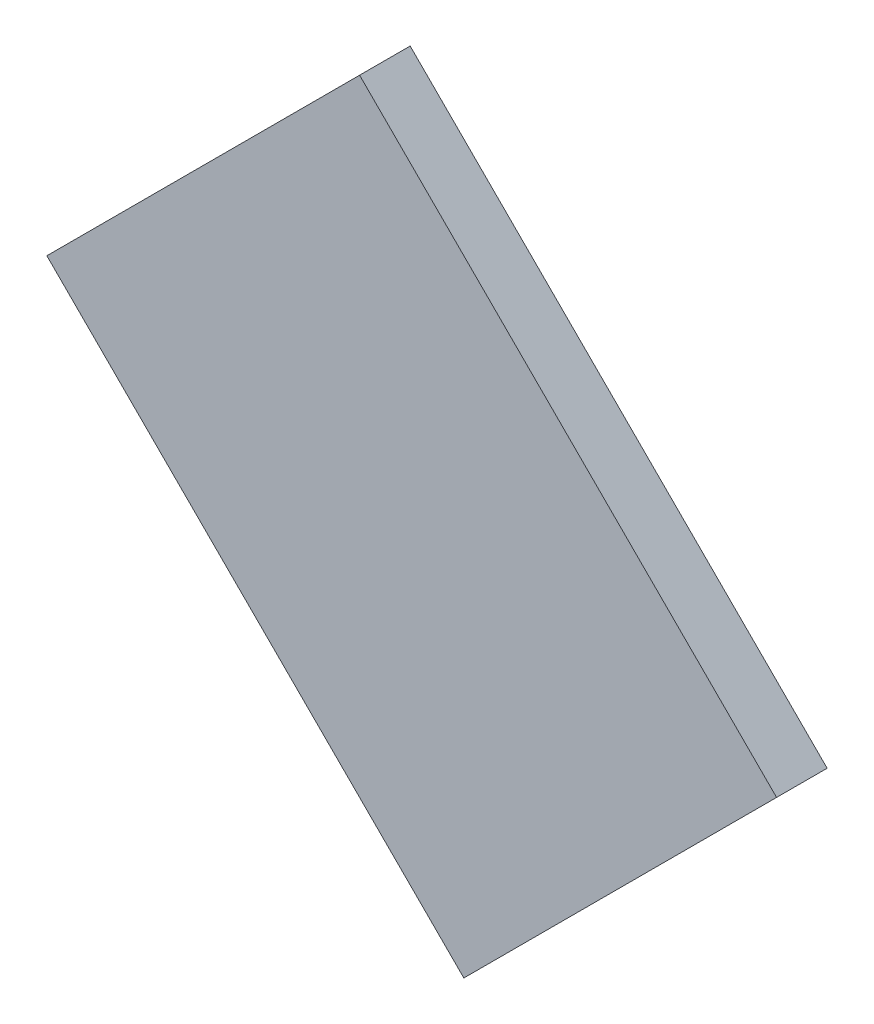
ISO-10303-21;
HEADER;
FILE_DESCRIPTION(('STEP AP214'),'2;1');
FILE_NAME('part.step','',(''),(''),'','','');
FILE_SCHEMA(('AUTOMOTIVE_DESIGN { 1 0 10303 214 1 1 1 1 }'));
ENDSEC;
DATA;
#1=APPLICATION_CONTEXT('core data for automotive mechanical design processes');
#2=APPLICATION_PROTOCOL_DEFINITION('international standard','automotive_design',2000,#1);
#3=PRODUCT_CONTEXT('',#1,'mechanical');
#4=PRODUCT('Part','Part','',(#3));
#5=PRODUCT_RELATED_PRODUCT_CATEGORY('part','',(#4));
#6=PRODUCT_DEFINITION_FORMATION('','',#4);
#7=PRODUCT_DEFINITION_CONTEXT('part definition',#1,'design');
#8=PRODUCT_DEFINITION('design','',#6,#7);
#9=PRODUCT_DEFINITION_SHAPE('','',#8);
#10=(LENGTH_UNIT() NAMED_UNIT(*) SI_UNIT(.MILLI.,.METRE.));
#11=(NAMED_UNIT(*) PLANE_ANGLE_UNIT() SI_UNIT($,.RADIAN.));
#12=(NAMED_UNIT(*) SI_UNIT($,.STERADIAN.) SOLID_ANGLE_UNIT());
#13=UNCERTAINTY_MEASURE_WITH_UNIT(LENGTH_MEASURE(1.E-05),#10,'distance_accuracy_value','');
#14=(GEOMETRIC_REPRESENTATION_CONTEXT(3) GLOBAL_UNCERTAINTY_ASSIGNED_CONTEXT((#13)) GLOBAL_UNIT_ASSIGNED_CONTEXT((#10,
#11,#12)) REPRESENTATION_CONTEXT('',''));
#15=CARTESIAN_POINT('',(0.,0.,0.));
#16=DIRECTION('',(0.,0.,1.));
#17=DIRECTION('',(1.,0.,0.));
#18=AXIS2_PLACEMENT_3D('',#15,#16,#17);
#19=CARTESIAN_POINT('',(4.9569546665,9.1733546665,0.79916));
#20=DIRECTION('',(0.,0.,1.));
#21=DIRECTION('',(0.,-1.,0.));
#22=AXIS2_PLACEMENT_3D('',#19,#20,#21);
#23=PLANE('',#22);
#24=DIRECTION('',(0.707106781186548,0.707106781186548,0.));
#25=VECTOR('',#24,1.);
#26=CARTESIAN_POINT('',(4.709467333,9.20871,0.79916));
#27=LINE('',#26,#25);
#28=CARTESIAN_POINT('',(4.921599333,9.420842,0.79916));
#29=VERTEX_POINT('',#28);
#30=CARTESIAN_POINT('',(4.709467333,9.20871,0.79916));
#31=VERTEX_POINT('',#30);
#32=EDGE_CURVE('E68',#29,#31,#27,.F.);
#33=ORIENTED_EDGE('',*,*,#32,.T.);
#34=DIRECTION('',(-0.707106781186548,0.707106781186548,0.));
#35=VECTOR('',#34,1.);
#36=CARTESIAN_POINT('',(4.99231,8.925867333,0.79916));
#37=LINE('',#36,#35);
#38=CARTESIAN_POINT('',(4.99231,8.925867333,0.79916));
#39=VERTEX_POINT('',#38);
#40=EDGE_CURVE('E55',#31,#39,#37,.F.);
#41=ORIENTED_EDGE('',*,*,#40,.T.);
#42=DIRECTION('',(-0.707106781186548,-0.707106781186548,0.));
#43=VECTOR('',#42,1.);
#44=CARTESIAN_POINT('',(5.204442,9.137999333,0.79916));
#45=LINE('',#44,#43);
#46=CARTESIAN_POINT('',(5.204442,9.137999333,0.79916));
#47=VERTEX_POINT('',#46);
#48=EDGE_CURVE('E20',#39,#47,#45,.F.);
#49=ORIENTED_EDGE('',*,*,#48,.T.);
#50=DIRECTION('',(0.707106781186548,-0.707106781186548,0.));
#51=VECTOR('',#50,1.);
#52=CARTESIAN_POINT('',(4.921599333,9.420842,0.79916));
#53=LINE('',#52,#51);
#54=EDGE_CURVE('E81',#47,#29,#53,.F.);
#55=ORIENTED_EDGE('',*,*,#54,.T.);
#56=EDGE_LOOP('',(#33,#41,#49,#55));
#57=FACE_BOUND('',#56,.T.);
#58=ADVANCED_FACE('F17',(#57),#23,.T.);
#59=CARTESIAN_POINT('',(5.204442,9.137999333,0.76487));
#60=DIRECTION('',(-0.707106781186548,0.707106781186548,0.));
#61=DIRECTION('',(-0.707106781186548,-0.707106781186548,0.));
#62=AXIS2_PLACEMENT_3D('',#59,#60,#61);
#63=PLANE('',#62);
#64=DIRECTION('',(0.,0.,1.));
#65=VECTOR('',#64,1.);
#66=CARTESIAN_POINT('',(4.99231,8.925867333,0.76487));
#67=LINE('',#66,#65);
#68=CARTESIAN_POINT('',(4.99231,8.925867333,0.76487));
#69=VERTEX_POINT('',#68);
#70=EDGE_CURVE('E61',#39,#69,#67,.F.);
#71=ORIENTED_EDGE('',*,*,#70,.T.);
#72=DIRECTION('',(-0.707106781186548,-0.707106781186548,0.));
#73=VECTOR('',#72,1.);
#74=CARTESIAN_POINT('',(5.204442,9.137999333,0.76487));
#75=LINE('',#74,#73);
#76=CARTESIAN_POINT('',(5.204442,9.137999333,0.76487));
#77=VERTEX_POINT('',#76);
#78=EDGE_CURVE('E83',#77,#69,#75,.T.);
#79=ORIENTED_EDGE('',*,*,#78,.F.);
#80=DIRECTION('',(0.,0.,1.));
#81=VECTOR('',#80,1.);
#82=CARTESIAN_POINT('',(5.204442,9.137999333,0.76487));
#83=LINE('',#82,#81);
#84=EDGE_CURVE('E64',#77,#47,#83,.T.);
#85=ORIENTED_EDGE('',*,*,#84,.T.);
#86=ORIENTED_EDGE('',*,*,#48,.F.);
#87=EDGE_LOOP('',(#71,#79,#85,#86));
#88=FACE_BOUND('',#87,.T.);
#89=ADVANCED_FACE('F60',(#88),#63,.F.);
#90=CARTESIAN_POINT('',(4.99231,8.925867333,0.76487));
#91=DIRECTION('',(0.707106781186548,0.707106781186548,0.));
#92=DIRECTION('',(-0.707106781186548,0.707106781186548,0.));
#93=AXIS2_PLACEMENT_3D('',#90,#91,#92);
#94=PLANE('',#93);
#95=DIRECTION('',(0.,0.,1.));
#96=VECTOR('',#95,1.);
#97=CARTESIAN_POINT('',(4.709467333,9.20871,0.76487));
#98=LINE('',#97,#96);
#99=CARTESIAN_POINT('',(4.709467333,9.20871,0.76487));
#100=VERTEX_POINT('',#99);
#101=EDGE_CURVE('E70',#31,#100,#98,.F.);
#102=ORIENTED_EDGE('',*,*,#101,.T.);
#103=DIRECTION('',(-0.707106781186546,0.707106781186549,0.));
#104=VECTOR('',#103,1.);
#105=CARTESIAN_POINT('',(4.99231,8.925867333,0.76487));
#106=LINE('',#105,#104);
#107=EDGE_CURVE('E74',#69,#100,#106,.T.);
#108=ORIENTED_EDGE('',*,*,#107,.F.);
#109=ORIENTED_EDGE('',*,*,#70,.F.);
#110=ORIENTED_EDGE('',*,*,#40,.F.);
#111=EDGE_LOOP('',(#102,#108,#109,#110));
#112=FACE_BOUND('',#111,.T.);
#113=ADVANCED_FACE('F72',(#112),#94,.F.);
#114=CARTESIAN_POINT('',(4.709467333,9.20871,0.76487));
#115=DIRECTION('',(0.707106781186548,-0.707106781186548,0.));
#116=DIRECTION('',(0.707106781186548,0.707106781186548,0.));
#117=AXIS2_PLACEMENT_3D('',#114,#115,#116);
#118=PLANE('',#117);
#119=DIRECTION('',(0.,0.,1.));
#120=VECTOR('',#119,1.);
#121=CARTESIAN_POINT('',(4.921599333,9.420842,0.76487));
#122=LINE('',#121,#120);
#123=CARTESIAN_POINT('',(4.921599333,9.420842,0.76487));
#124=VERTEX_POINT('',#123);
#125=EDGE_CURVE('E35',#29,#124,#122,.F.);
#126=ORIENTED_EDGE('',*,*,#125,.T.);
#127=DIRECTION('',(0.707106781186546,0.707106781186549,0.));
#128=VECTOR('',#127,1.);
#129=CARTESIAN_POINT('',(4.709467333,9.20871,0.76487));
#130=LINE('',#129,#128);
#131=EDGE_CURVE('E26',#100,#124,#130,.T.);
#132=ORIENTED_EDGE('',*,*,#131,.F.);
#133=ORIENTED_EDGE('',*,*,#101,.F.);
#134=ORIENTED_EDGE('',*,*,#32,.F.);
#135=EDGE_LOOP('',(#126,#132,#133,#134));
#136=FACE_BOUND('',#135,.T.);
#137=ADVANCED_FACE('F89',(#136),#118,.F.);
#138=CARTESIAN_POINT('',(4.921599333,9.420842,0.76487));
#139=DIRECTION('',(-0.707106781186548,-0.707106781186548,0.));
#140=DIRECTION('',(0.707106781186548,-0.707106781186548,0.));
#141=AXIS2_PLACEMENT_3D('',#138,#139,#140);
#142=PLANE('',#141);
#143=ORIENTED_EDGE('',*,*,#84,.F.);
#144=DIRECTION('',(0.707106781186548,-0.707106781186548,0.));
#145=VECTOR('',#144,1.);
#146=CARTESIAN_POINT('',(4.921599333,9.420842,0.76487));
#147=LINE('',#146,#145);
#148=EDGE_CURVE('E11',#124,#77,#147,.T.);
#149=ORIENTED_EDGE('',*,*,#148,.F.);
#150=ORIENTED_EDGE('',*,*,#125,.F.);
#151=ORIENTED_EDGE('',*,*,#54,.F.);
#152=EDGE_LOOP('',(#143,#149,#150,#151));
#153=FACE_BOUND('',#152,.T.);
#154=ADVANCED_FACE('F91',(#153),#142,.F.);
#155=CARTESIAN_POINT('',(4.9569546665,9.1733546665,0.76487));
#156=DIRECTION('',(0.,0.,-1.));
#157=DIRECTION('',(0.,1.,0.));
#158=AXIS2_PLACEMENT_3D('',#155,#156,#157);
#159=PLANE('',#158);
#160=ORIENTED_EDGE('',*,*,#131,.T.);
#161=ORIENTED_EDGE('',*,*,#148,.T.);
#162=ORIENTED_EDGE('',*,*,#78,.T.);
#163=ORIENTED_EDGE('',*,*,#107,.T.);
#164=EDGE_LOOP('',(#160,#161,#162,#163));
#165=FACE_BOUND('',#164,.T.);
#166=ADVANCED_FACE('F88',(#165),#159,.T.);
#167=CLOSED_SHELL('',(#58,#89,#113,#137,#154,#166));
#168=MANIFOLD_SOLID_BREP('B1',#167);
#169=ADVANCED_BREP_SHAPE_REPRESENTATION('',(#18,#168),#14);
#170=SHAPE_DEFINITION_REPRESENTATION(#9,#169);
ENDSEC;
END-ISO-10303-21;
